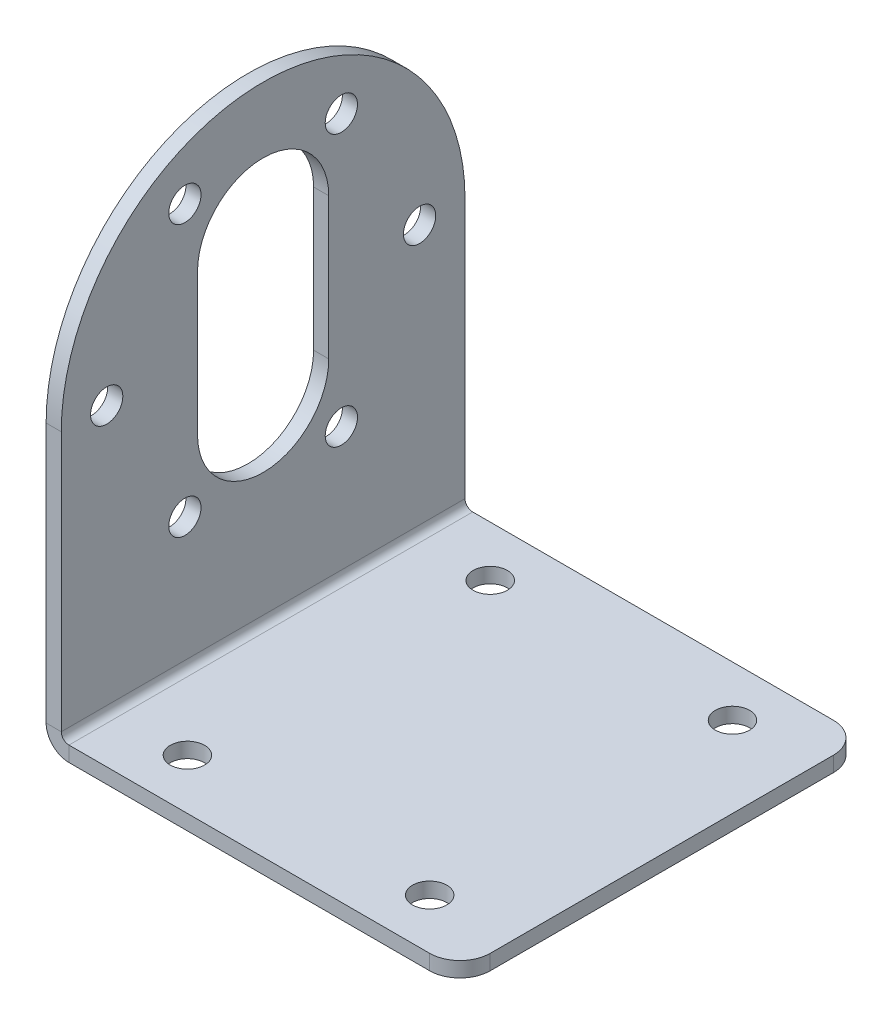
ISO-10303-21;
HEADER;
FILE_DESCRIPTION(('STEP AP214'),'2;1');
FILE_NAME('part.step','',(''),(''),'','','');
FILE_SCHEMA(('AUTOMOTIVE_DESIGN { 1 0 10303 214 1 1 1 1 }'));
ENDSEC;
DATA;
#1=APPLICATION_CONTEXT('core data for automotive mechanical design processes');
#2=APPLICATION_PROTOCOL_DEFINITION('international standard','automotive_design',2000,#1);
#3=PRODUCT_CONTEXT('',#1,'mechanical');
#4=PRODUCT('Part','Part','',(#3));
#5=PRODUCT_RELATED_PRODUCT_CATEGORY('part','',(#4));
#6=PRODUCT_DEFINITION_FORMATION('','',#4);
#7=PRODUCT_DEFINITION_CONTEXT('part definition',#1,'design');
#8=PRODUCT_DEFINITION('design','',#6,#7);
#9=PRODUCT_DEFINITION_SHAPE('','',#8);
#10=(LENGTH_UNIT() NAMED_UNIT(*) SI_UNIT(.MILLI.,.METRE.));
#11=(NAMED_UNIT(*) PLANE_ANGLE_UNIT() SI_UNIT($,.RADIAN.));
#12=(NAMED_UNIT(*) SI_UNIT($,.STERADIAN.) SOLID_ANGLE_UNIT());
#13=UNCERTAINTY_MEASURE_WITH_UNIT(LENGTH_MEASURE(1.E-05),#10,'distance_accuracy_value','');
#14=(GEOMETRIC_REPRESENTATION_CONTEXT(3) GLOBAL_UNCERTAINTY_ASSIGNED_CONTEXT((#13)) GLOBAL_UNIT_ASSIGNED_CONTEXT((#10,
#11,#12)) REPRESENTATION_CONTEXT('',''));
#15=CARTESIAN_POINT('',(0.,0.,0.));
#16=DIRECTION('',(0.,0.,1.));
#17=DIRECTION('',(1.,0.,0.));
#18=AXIS2_PLACEMENT_3D('',#15,#16,#17);
#19=CARTESIAN_POINT('',(0.,0.,0.));
#20=DIRECTION('',(1.,0.,0.));
#21=DIRECTION('',(0.,0.,-1.));
#22=AXIS2_PLACEMENT_3D('',#19,#20,#21);
#23=PLANE('',#22);
#24=DIRECTION('',(0.,-1.,0.));
#25=VECTOR('',#24,1.);
#26=CARTESIAN_POINT('',(0.,7.,-6.5));
#27=LINE('',#26,#25);
#28=CARTESIAN_POINT('',(0.,7.,-6.5));
#29=VERTEX_POINT('',#28);
#30=CARTESIAN_POINT('',(0.,-7.,-6.5));
#31=VERTEX_POINT('',#30);
#32=EDGE_CURVE('E160',#29,#31,#27,.T.);
#33=ORIENTED_EDGE('',*,*,#32,.F.);
#34=CARTESIAN_POINT('',(0.,7.,0.));
#35=DIRECTION('',(-1.,0.,0.));
#36=DIRECTION('',(0.,0.,1.));
#37=AXIS2_PLACEMENT_3D('',#34,#35,#36);
#38=CIRCLE('',#37,6.5);
#39=CARTESIAN_POINT('',(0.,7.,6.5));
#40=VERTEX_POINT('',#39);
#41=EDGE_CURVE('E165',#40,#29,#38,.T.);
#42=ORIENTED_EDGE('',*,*,#41,.F.);
#43=DIRECTION('',(0.,1.,0.));
#44=VECTOR('',#43,1.);
#45=CARTESIAN_POINT('',(0.,7.,6.5));
#46=LINE('',#45,#44);
#47=CARTESIAN_POINT('',(0.,-7.,6.5));
#48=VERTEX_POINT('',#47);
#49=EDGE_CURVE('E169',#48,#40,#46,.T.);
#50=ORIENTED_EDGE('',*,*,#49,.F.);
#51=CARTESIAN_POINT('',(0.,-7.,0.));
#52=DIRECTION('',(-1.,0.,0.));
#53=DIRECTION('',(0.,0.,1.));
#54=AXIS2_PLACEMENT_3D('',#51,#52,#53);
#55=CIRCLE('',#54,6.5);
#56=EDGE_CURVE('E149',#31,#48,#55,.T.);
#57=ORIENTED_EDGE('',*,*,#56,.F.);
#58=EDGE_LOOP('',(#33,#42,#50,#57));
#59=FACE_BOUND('',#58,.T.);
#60=CARTESIAN_POINT('',(0.,-13.4233937586589,7.74999999999988));
#61=DIRECTION('',(-1.,0.,0.));
#62=DIRECTION('',(0.,0.,1.));
#63=AXIS2_PLACEMENT_3D('',#60,#61,#62);
#64=CIRCLE('',#63,1.6);
#65=CARTESIAN_POINT('',(0.,-13.4233937586589,9.34999999999988));
#66=VERTEX_POINT('',#65);
#67=EDGE_CURVE('E184',#66,#66,#64,.T.);
#68=ORIENTED_EDGE('',*,*,#67,.F.);
#69=EDGE_LOOP('',(#68));
#70=FACE_BOUND('',#69,.T.);
#71=CARTESIAN_POINT('',(0.,13.4233937586588,7.75000000000006));
#72=DIRECTION('',(-1.,0.,0.));
#73=DIRECTION('',(0.,0.,1.));
#74=AXIS2_PLACEMENT_3D('',#71,#72,#73);
#75=CIRCLE('',#74,1.6);
#76=CARTESIAN_POINT('',(0.,13.4233937586588,9.35000000000006));
#77=VERTEX_POINT('',#76);
#78=EDGE_CURVE('E196',#77,#77,#75,.T.);
#79=ORIENTED_EDGE('',*,*,#78,.F.);
#80=EDGE_LOOP('',(#79));
#81=FACE_BOUND('',#80,.T.);
#82=CARTESIAN_POINT('',(0.,13.4233937586588,-7.74999999999997));
#83=DIRECTION('',(-1.,0.,0.));
#84=DIRECTION('',(0.,0.,1.));
#85=AXIS2_PLACEMENT_3D('',#82,#83,#84);
#86=CIRCLE('',#85,1.6);
#87=CARTESIAN_POINT('',(0.,13.4233937586588,-6.14999999999997));
#88=VERTEX_POINT('',#87);
#89=EDGE_CURVE('E202',#88,#88,#86,.T.);
#90=ORIENTED_EDGE('',*,*,#89,.F.);
#91=EDGE_LOOP('',(#90));
#92=FACE_BOUND('',#91,.T.);
#93=CARTESIAN_POINT('',(0.,0.,-15.5));
#94=DIRECTION('',(-1.,0.,0.));
#95=DIRECTION('',(0.,0.,1.));
#96=AXIS2_PLACEMENT_3D('',#93,#94,#95);
#97=CIRCLE('',#96,1.6);
#98=CARTESIAN_POINT('',(0.,0.,-13.9));
#99=VERTEX_POINT('',#98);
#100=EDGE_CURVE('E206',#99,#99,#97,.T.);
#101=ORIENTED_EDGE('',*,*,#100,.F.);
#102=EDGE_LOOP('',(#101));
#103=FACE_BOUND('',#102,.T.);
#104=DIRECTION('',(0.,1.,0.));
#105=VECTOR('',#104,1.);
#106=CARTESIAN_POINT('',(0.,0.,-20.));
#107=LINE('',#106,#105);
#108=CARTESIAN_POINT('',(0.,-25.738,-20.));
#109=VERTEX_POINT('',#108);
#110=CARTESIAN_POINT('',(0.,0.,-20.));
#111=VERTEX_POINT('',#110);
#112=EDGE_CURVE('E227',#109,#111,#107,.T.);
#113=ORIENTED_EDGE('',*,*,#112,.F.);
#114=DIRECTION('',(0.,0.,-1.));
#115=VECTOR('',#114,1.);
#116=CARTESIAN_POINT('',(0.,-25.738,0.));
#117=LINE('',#116,#115);
#118=CARTESIAN_POINT('',(0.,-25.738,20.));
#119=VERTEX_POINT('',#118);
#120=EDGE_CURVE('E233',#109,#119,#117,.F.);
#121=ORIENTED_EDGE('',*,*,#120,.T.);
#122=DIRECTION('',(0.,-1.,0.));
#123=VECTOR('',#122,1.);
#124=CARTESIAN_POINT('',(0.,0.,20.));
#125=LINE('',#124,#123);
#126=CARTESIAN_POINT('',(0.,0.,20.));
#127=VERTEX_POINT('',#126);
#128=EDGE_CURVE('E221',#127,#119,#125,.T.);
#129=ORIENTED_EDGE('',*,*,#128,.F.);
#130=CARTESIAN_POINT('',(0.,0.,0.));
#131=DIRECTION('',(1.,0.,0.));
#132=DIRECTION('',(0.,0.,-1.));
#133=AXIS2_PLACEMENT_3D('',#130,#131,#132);
#134=CIRCLE('',#133,20.);
#135=EDGE_CURVE('E224',#111,#127,#134,.T.);
#136=ORIENTED_EDGE('',*,*,#135,.F.);
#137=EDGE_LOOP('',(#113,#121,#129,#136));
#138=FACE_BOUND('',#137,.T.);
#139=CARTESIAN_POINT('',(0.,0.,15.5));
#140=DIRECTION('',(-1.,0.,0.));
#141=DIRECTION('',(0.,0.,1.));
#142=AXIS2_PLACEMENT_3D('',#139,#140,#141);
#143=CIRCLE('',#142,1.6);
#144=CARTESIAN_POINT('',(0.,0.,17.1));
#145=VERTEX_POINT('',#144);
#146=EDGE_CURVE('E190',#145,#145,#143,.T.);
#147=ORIENTED_EDGE('',*,*,#146,.F.);
#148=EDGE_LOOP('',(#147));
#149=FACE_BOUND('',#148,.T.);
#150=CARTESIAN_POINT('',(0.,-13.4233937586587,-7.75000000000016));
#151=DIRECTION('',(-1.,0.,0.));
#152=DIRECTION('',(0.,0.,1.));
#153=AXIS2_PLACEMENT_3D('',#150,#151,#152);
#154=CIRCLE('',#153,1.6);
#155=CARTESIAN_POINT('',(0.,-13.4233937586587,-6.15000000000016));
#156=VERTEX_POINT('',#155);
#157=EDGE_CURVE('E176',#156,#156,#154,.T.);
#158=ORIENTED_EDGE('',*,*,#157,.F.);
#159=EDGE_LOOP('',(#158));
#160=FACE_BOUND('',#159,.T.);
#161=ADVANCED_FACE('F43',(#59,#70,#81,#92,#103,#138,#149,#160),#23,.F.);
#162=CARTESIAN_POINT('',(1.5,-28.,-20.));
#163=DIRECTION('',(0.,0.,-1.));
#164=DIRECTION('',(-1.,0.,0.));
#165=AXIS2_PLACEMENT_3D('',#162,#163,#164);
#166=PLANE('',#165);
#167=DIRECTION('',(1.,0.,0.));
#168=VECTOR('',#167,1.);
#169=CARTESIAN_POINT('',(1.5,-26.5,-20.));
#170=LINE('',#169,#168);
#171=CARTESIAN_POINT('',(38.,-26.5,-20.));
#172=VERTEX_POINT('',#171);
#173=CARTESIAN_POINT('',(2.262,-26.5,-20.));
#174=VERTEX_POINT('',#173);
#175=EDGE_CURVE('E261',#172,#174,#170,.F.);
#176=ORIENTED_EDGE('',*,*,#175,.F.);
#177=DIRECTION('',(0.,1.,0.));
#178=VECTOR('',#177,1.);
#179=CARTESIAN_POINT('',(38.,-28.,-20.));
#180=LINE('',#179,#178);
#181=CARTESIAN_POINT('',(38.,-28.,-20.));
#182=VERTEX_POINT('',#181);
#183=EDGE_CURVE('E290',#172,#182,#180,.F.);
#184=ORIENTED_EDGE('',*,*,#183,.T.);
#185=DIRECTION('',(-1.,0.,0.));
#186=VECTOR('',#185,1.);
#187=CARTESIAN_POINT('',(1.5,-28.,-20.));
#188=LINE('',#187,#186);
#189=CARTESIAN_POINT('',(2.262,-28.,-20.));
#190=VERTEX_POINT('',#189);
#191=EDGE_CURVE('E213',#182,#190,#188,.T.);
#192=ORIENTED_EDGE('',*,*,#191,.T.);
#193=DIRECTION('',(0.,-1.,0.));
#194=VECTOR('',#193,1.);
#195=CARTESIAN_POINT('',(2.262,-28.,-20.));
#196=LINE('',#195,#194);
#197=EDGE_CURVE('E277',#174,#190,#196,.T.);
#198=ORIENTED_EDGE('',*,*,#197,.F.);
#199=EDGE_LOOP('',(#176,#184,#192,#198));
#200=FACE_BOUND('',#199,.T.);
#201=ADVANCED_FACE('F311',(#200),#166,.T.);
#202=CARTESIAN_POINT('',(41.,-28.,20.));
#203=DIRECTION('',(-1.,0.,0.));
#204=DIRECTION('',(0.,0.,1.));
#205=AXIS2_PLACEMENT_3D('',#202,#203,#204);
#206=PLANE('',#205);
#207=DIRECTION('',(0.,0.,1.));
#208=VECTOR('',#207,1.);
#209=CARTESIAN_POINT('',(41.,-28.,20.));
#210=LINE('',#209,#208);
#211=CARTESIAN_POINT('',(41.,-28.,-17.));
#212=VERTEX_POINT('',#211);
#213=CARTESIAN_POINT('',(41.,-28.,17.));
#214=VERTEX_POINT('',#213);
#215=EDGE_CURVE('E215',#212,#214,#210,.T.);
#216=ORIENTED_EDGE('',*,*,#215,.F.);
#217=DIRECTION('',(0.,-1.,0.));
#218=VECTOR('',#217,1.);
#219=CARTESIAN_POINT('',(41.,-28.,-17.));
#220=LINE('',#219,#218);
#221=CARTESIAN_POINT('',(41.,-26.5,-17.));
#222=VERTEX_POINT('',#221);
#223=EDGE_CURVE('E300',#212,#222,#220,.F.);
#224=ORIENTED_EDGE('',*,*,#223,.T.);
#225=DIRECTION('',(0.,0.,1.));
#226=VECTOR('',#225,1.);
#227=CARTESIAN_POINT('',(41.,-26.5,20.));
#228=LINE('',#227,#226);
#229=CARTESIAN_POINT('',(41.,-26.5,17.));
#230=VERTEX_POINT('',#229);
#231=EDGE_CURVE('E263',#222,#230,#228,.T.);
#232=ORIENTED_EDGE('',*,*,#231,.T.);
#233=DIRECTION('',(0.,1.,0.));
#234=VECTOR('',#233,1.);
#235=CARTESIAN_POINT('',(41.,-28.,17.));
#236=LINE('',#235,#234);
#237=EDGE_CURVE('E297',#230,#214,#236,.F.);
#238=ORIENTED_EDGE('',*,*,#237,.T.);
#239=EDGE_LOOP('',(#216,#224,#232,#238));
#240=FACE_BOUND('',#239,.T.);
#241=ADVANCED_FACE('F318',(#240),#206,.F.);
#242=CARTESIAN_POINT('',(1.5,-28.,20.));
#243=DIRECTION('',(0.,0.,-1.));
#244=DIRECTION('',(-1.,0.,0.));
#245=AXIS2_PLACEMENT_3D('',#242,#243,#244);
#246=PLANE('',#245);
#247=DIRECTION('',(-1.,0.,0.));
#248=VECTOR('',#247,1.);
#249=CARTESIAN_POINT('',(1.5,-28.,20.));
#250=LINE('',#249,#248);
#251=CARTESIAN_POINT('',(38.,-28.,20.));
#252=VERTEX_POINT('',#251);
#253=CARTESIAN_POINT('',(2.262,-28.,20.));
#254=VERTEX_POINT('',#253);
#255=EDGE_CURVE('E219',#252,#254,#250,.T.);
#256=ORIENTED_EDGE('',*,*,#255,.F.);
#257=DIRECTION('',(0.,1.,0.));
#258=VECTOR('',#257,1.);
#259=CARTESIAN_POINT('',(38.,-28.,20.));
#260=LINE('',#259,#258);
#261=CARTESIAN_POINT('',(38.,-26.5,20.));
#262=VERTEX_POINT('',#261);
#263=EDGE_CURVE('E11',#252,#262,#260,.T.);
#264=ORIENTED_EDGE('',*,*,#263,.T.);
#265=DIRECTION('',(1.,0.,0.));
#266=VECTOR('',#265,1.);
#267=CARTESIAN_POINT('',(1.5,-26.5,20.));
#268=LINE('',#267,#266);
#269=CARTESIAN_POINT('',(2.262,-26.5,20.));
#270=VERTEX_POINT('',#269);
#271=EDGE_CURVE('E257',#262,#270,#268,.F.);
#272=ORIENTED_EDGE('',*,*,#271,.T.);
#273=DIRECTION('',(0.,-1.,0.));
#274=VECTOR('',#273,1.);
#275=CARTESIAN_POINT('',(2.262,-28.,20.));
#276=LINE('',#275,#274);
#277=EDGE_CURVE('E274',#270,#254,#276,.T.);
#278=ORIENTED_EDGE('',*,*,#277,.T.);
#279=EDGE_LOOP('',(#256,#264,#272,#278));
#280=FACE_BOUND('',#279,.T.);
#281=ADVANCED_FACE('F321',(#280),#246,.F.);
#282=CARTESIAN_POINT('',(2.262,-25.738,20.));
#283=DIRECTION('',(0.,0.,1.));
#284=DIRECTION('',(0.,-1.,0.));
#285=AXIS2_PLACEMENT_3D('',#282,#283,#284);
#286=PLANE('',#285);
#287=ORIENTED_EDGE('',*,*,#277,.F.);
#288=CARTESIAN_POINT('',(2.262,-25.738,20.));
#289=DIRECTION('',(0.,0.,-1.));
#290=DIRECTION('',(-1.,0.,0.));
#291=AXIS2_PLACEMENT_3D('',#288,#289,#290);
#292=CIRCLE('',#291,0.762);
#293=CARTESIAN_POINT('',(1.5,-25.738,20.));
#294=VERTEX_POINT('',#293);
#295=EDGE_CURVE('E258',#270,#294,#292,.T.);
#296=ORIENTED_EDGE('',*,*,#295,.T.);
#297=DIRECTION('',(-1.,0.,0.));
#298=VECTOR('',#297,1.);
#299=CARTESIAN_POINT('',(0.,-25.738,20.));
#300=LINE('',#299,#298);
#301=EDGE_CURVE('E272',#294,#119,#300,.T.);
#302=ORIENTED_EDGE('',*,*,#301,.T.);
#303=CARTESIAN_POINT('',(2.262,-25.738,20.));
#304=DIRECTION('',(0.,0.,-1.));
#305=DIRECTION('',(0.,1.,0.));
#306=AXIS2_PLACEMENT_3D('',#303,#304,#305);
#307=CIRCLE('',#306,2.262);
#308=EDGE_CURVE('E216',#254,#119,#307,.T.);
#309=ORIENTED_EDGE('',*,*,#308,.F.);
#310=EDGE_LOOP('',(#287,#296,#302,#309));
#311=FACE_BOUND('',#310,.T.);
#312=ADVANCED_FACE('F326',(#311),#286,.T.);
#313=CARTESIAN_POINT('',(0.,0.,20.));
#314=DIRECTION('',(0.,0.,1.));
#315=DIRECTION('',(0.,-1.,0.));
#316=AXIS2_PLACEMENT_3D('',#313,#314,#315);
#317=PLANE('',#316);
#318=ORIENTED_EDGE('',*,*,#301,.F.);
#319=DIRECTION('',(0.,1.,0.));
#320=VECTOR('',#319,1.);
#321=CARTESIAN_POINT('',(1.5,0.,20.));
#322=LINE('',#321,#320);
#323=CARTESIAN_POINT('',(1.5,0.,20.));
#324=VERTEX_POINT('',#323);
#325=EDGE_CURVE('E254',#324,#294,#322,.F.);
#326=ORIENTED_EDGE('',*,*,#325,.F.);
#327=DIRECTION('',(-1.,0.,0.));
#328=VECTOR('',#327,1.);
#329=CARTESIAN_POINT('',(0.,0.,20.));
#330=LINE('',#329,#328);
#331=EDGE_CURVE('E270',#324,#127,#330,.T.);
#332=ORIENTED_EDGE('',*,*,#331,.T.);
#333=ORIENTED_EDGE('',*,*,#128,.T.);
#334=EDGE_LOOP('',(#318,#326,#332,#333));
#335=FACE_BOUND('',#334,.T.);
#336=ADVANCED_FACE('F509',(#335),#317,.T.);
#337=CARTESIAN_POINT('',(0.,0.,0.));
#338=DIRECTION('',(1.,0.,0.));
#339=DIRECTION('',(0.,0.,-1.));
#340=AXIS2_PLACEMENT_3D('',#337,#338,#339);
#341=CYLINDRICAL_SURFACE('',#340,20.);
#342=ORIENTED_EDGE('',*,*,#331,.F.);
#343=CARTESIAN_POINT('',(1.5,0.,0.));
#344=DIRECTION('',(1.,0.,0.));
#345=DIRECTION('',(0.,0.,-1.));
#346=AXIS2_PLACEMENT_3D('',#343,#344,#345);
#347=CIRCLE('',#346,20.);
#348=CARTESIAN_POINT('',(1.5,0.,-20.));
#349=VERTEX_POINT('',#348);
#350=EDGE_CURVE('E251',#349,#324,#347,.T.);
#351=ORIENTED_EDGE('',*,*,#350,.F.);
#352=DIRECTION('',(-1.,0.,0.));
#353=VECTOR('',#352,1.);
#354=CARTESIAN_POINT('',(0.,0.,-20.));
#355=LINE('',#354,#353);
#356=EDGE_CURVE('E268',#349,#111,#355,.T.);
#357=ORIENTED_EDGE('',*,*,#356,.T.);
#358=ORIENTED_EDGE('',*,*,#135,.T.);
#359=EDGE_LOOP('',(#342,#351,#357,#358));
#360=FACE_BOUND('',#359,.T.);
#361=ADVANCED_FACE('F501',(#360),#341,.T.);
#362=CARTESIAN_POINT('',(0.,0.,-20.));
#363=DIRECTION('',(0.,0.,-1.));
#364=DIRECTION('',(0.,1.,0.));
#365=AXIS2_PLACEMENT_3D('',#362,#363,#364);
#366=PLANE('',#365);
#367=ORIENTED_EDGE('',*,*,#356,.F.);
#368=DIRECTION('',(0.,1.,0.));
#369=VECTOR('',#368,1.);
#370=CARTESIAN_POINT('',(1.5,0.,-20.));
#371=LINE('',#370,#369);
#372=CARTESIAN_POINT('',(1.5,-25.738,-20.));
#373=VERTEX_POINT('',#372);
#374=EDGE_CURVE('E248',#373,#349,#371,.T.);
#375=ORIENTED_EDGE('',*,*,#374,.F.);
#376=DIRECTION('',(-1.,0.,0.));
#377=VECTOR('',#376,1.);
#378=CARTESIAN_POINT('',(0.,-25.738,-20.));
#379=LINE('',#378,#377);
#380=EDGE_CURVE('E236',#373,#109,#379,.T.);
#381=ORIENTED_EDGE('',*,*,#380,.T.);
#382=ORIENTED_EDGE('',*,*,#112,.T.);
#383=EDGE_LOOP('',(#367,#375,#381,#382));
#384=FACE_BOUND('',#383,.T.);
#385=ADVANCED_FACE('F340',(#384),#366,.T.);
#386=CARTESIAN_POINT('',(2.262,-25.738,-20.));
#387=DIRECTION('',(0.,0.,1.));
#388=DIRECTION('',(0.,-1.,0.));
#389=AXIS2_PLACEMENT_3D('',#386,#387,#388);
#390=PLANE('',#389);
#391=CARTESIAN_POINT('',(2.262,-25.738,-20.));
#392=DIRECTION('',(0.,0.,-1.));
#393=DIRECTION('',(-1.,0.,0.));
#394=AXIS2_PLACEMENT_3D('',#391,#392,#393);
#395=CIRCLE('',#394,0.762);
#396=EDGE_CURVE('E212',#373,#174,#395,.F.);
#397=ORIENTED_EDGE('',*,*,#396,.T.);
#398=ORIENTED_EDGE('',*,*,#197,.T.);
#399=CARTESIAN_POINT('',(2.262,-25.738,-20.));
#400=DIRECTION('',(0.,0.,-1.));
#401=DIRECTION('',(0.,1.,0.));
#402=AXIS2_PLACEMENT_3D('',#399,#400,#401);
#403=CIRCLE('',#402,2.262);
#404=EDGE_CURVE('E237',#109,#190,#403,.F.);
#405=ORIENTED_EDGE('',*,*,#404,.F.);
#406=ORIENTED_EDGE('',*,*,#380,.F.);
#407=EDGE_LOOP('',(#397,#398,#405,#406));
#408=FACE_BOUND('',#407,.T.);
#409=ADVANCED_FACE('F333',(#408),#390,.F.);
#410=CARTESIAN_POINT('',(1.5,-28.,20.));
#411=DIRECTION('',(0.,1.,0.));
#412=DIRECTION('',(0.,0.,1.));
#413=AXIS2_PLACEMENT_3D('',#410,#411,#412);
#414=PLANE('',#413);
#415=CARTESIAN_POINT('',(9.00000000000001,-28.,-15.));
#416=DIRECTION('',(0.,1.,0.));
#417=DIRECTION('',(0.,0.,1.));
#418=AXIS2_PLACEMENT_3D('',#415,#416,#417);
#419=CIRCLE('',#418,1.7);
#420=CARTESIAN_POINT('',(9.00000000000001,-28.,-13.3));
#421=VERTEX_POINT('',#420);
#422=EDGE_CURVE('E452',#421,#421,#419,.T.);
#423=ORIENTED_EDGE('',*,*,#422,.T.);
#424=EDGE_LOOP('',(#423));
#425=FACE_BOUND('',#424,.T.);
#426=CARTESIAN_POINT('',(9.00000000000001,-28.,15.));
#427=DIRECTION('',(0.,1.,0.));
#428=DIRECTION('',(0.,0.,1.));
#429=AXIS2_PLACEMENT_3D('',#426,#427,#428);
#430=CIRCLE('',#429,1.7);
#431=CARTESIAN_POINT('',(9.00000000000001,-28.,16.7));
#432=VERTEX_POINT('',#431);
#433=EDGE_CURVE('E456',#432,#432,#430,.T.);
#434=ORIENTED_EDGE('',*,*,#433,.T.);
#435=EDGE_LOOP('',(#434));
#436=FACE_BOUND('',#435,.T.);
#437=CARTESIAN_POINT('',(33.,-28.,15.));
#438=DIRECTION('',(0.,1.,0.));
#439=DIRECTION('',(0.,0.,1.));
#440=AXIS2_PLACEMENT_3D('',#437,#438,#439);
#441=CIRCLE('',#440,1.7);
#442=CARTESIAN_POINT('',(33.,-28.,16.7));
#443=VERTEX_POINT('',#442);
#444=EDGE_CURVE('E468',#443,#443,#441,.T.);
#445=ORIENTED_EDGE('',*,*,#444,.T.);
#446=EDGE_LOOP('',(#445));
#447=FACE_BOUND('',#446,.T.);
#448=CARTESIAN_POINT('',(33.,-28.,-15.));
#449=DIRECTION('',(0.,1.,0.));
#450=DIRECTION('',(0.,0.,1.));
#451=AXIS2_PLACEMENT_3D('',#448,#449,#450);
#452=CIRCLE('',#451,1.7);
#453=CARTESIAN_POINT('',(33.,-28.,-13.3));
#454=VERTEX_POINT('',#453);
#455=EDGE_CURVE('E474',#454,#454,#452,.T.);
#456=ORIENTED_EDGE('',*,*,#455,.T.);
#457=EDGE_LOOP('',(#456));
#458=FACE_BOUND('',#457,.T.);
#459=ORIENTED_EDGE('',*,*,#191,.F.);
#460=CARTESIAN_POINT('',(38.,-28.,-17.));
#461=DIRECTION('',(0.,1.,0.));
#462=DIRECTION('',(0.,0.,1.));
#463=AXIS2_PLACEMENT_3D('',#460,#461,#462);
#464=CIRCLE('',#463,3.);
#465=EDGE_CURVE('E295',#182,#212,#464,.F.);
#466=ORIENTED_EDGE('',*,*,#465,.T.);
#467=ORIENTED_EDGE('',*,*,#215,.T.);
#468=CARTESIAN_POINT('',(38.,-28.,17.));
#469=DIRECTION('',(0.,1.,0.));
#470=DIRECTION('',(0.,0.,1.));
#471=AXIS2_PLACEMENT_3D('',#468,#469,#470);
#472=CIRCLE('',#471,3.);
#473=EDGE_CURVE('E293',#214,#252,#472,.F.);
#474=ORIENTED_EDGE('',*,*,#473,.T.);
#475=ORIENTED_EDGE('',*,*,#255,.T.);
#476=DIRECTION('',(0.,0.,-1.));
#477=VECTOR('',#476,1.);
#478=CARTESIAN_POINT('',(2.262,-28.,20.));
#479=LINE('',#478,#477);
#480=EDGE_CURVE('E230',#254,#190,#479,.T.);
#481=ORIENTED_EDGE('',*,*,#480,.T.);
#482=EDGE_LOOP('',(#459,#466,#467,#474,#475,#481));
#483=FACE_BOUND('',#482,.T.);
#484=ADVANCED_FACE('F316',(#425,#436,#447,#458,#483),#414,.F.);
#485=CARTESIAN_POINT('',(2.262,-25.738,20.));
#486=DIRECTION('',(0.,0.,-1.));
#487=DIRECTION('',(-1.,0.,0.));
#488=AXIS2_PLACEMENT_3D('',#485,#486,#487);
#489=CYLINDRICAL_SURFACE('',#488,2.262);
#490=ORIENTED_EDGE('',*,*,#308,.T.);
#491=ORIENTED_EDGE('',*,*,#120,.F.);
#492=ORIENTED_EDGE('',*,*,#404,.T.);
#493=ORIENTED_EDGE('',*,*,#480,.F.);
#494=EDGE_LOOP('',(#490,#491,#492,#493));
#495=FACE_BOUND('',#494,.T.);
#496=ADVANCED_FACE('F329',(#495),#489,.T.);
#497=CARTESIAN_POINT('',(1.5,0.,0.));
#498=DIRECTION('',(1.,0.,0.));
#499=DIRECTION('',(0.,0.,-1.));
#500=AXIS2_PLACEMENT_3D('',#497,#498,#499);
#501=PLANE('',#500);
#502=CARTESIAN_POINT('',(1.5,7.,0.));
#503=DIRECTION('',(1.,0.,0.));
#504=DIRECTION('',(0.,0.,-1.));
#505=AXIS2_PLACEMENT_3D('',#502,#503,#504);
#506=CIRCLE('',#505,6.5);
#507=CARTESIAN_POINT('',(1.50000000000002,7.,-6.5));
#508=VERTEX_POINT('',#507);
#509=CARTESIAN_POINT('',(1.50000000000002,7.,6.5));
#510=VERTEX_POINT('',#509);
#511=EDGE_CURVE('E288',#508,#510,#506,.T.);
#512=ORIENTED_EDGE('',*,*,#511,.F.);
#513=DIRECTION('',(0.,1.,0.));
#514=VECTOR('',#513,1.);
#515=CARTESIAN_POINT('',(1.5,0.,-6.5));
#516=LINE('',#515,#514);
#517=CARTESIAN_POINT('',(1.5,-7.,-6.5));
#518=VERTEX_POINT('',#517);
#519=EDGE_CURVE('E280',#518,#508,#516,.T.);
#520=ORIENTED_EDGE('',*,*,#519,.F.);
#521=CARTESIAN_POINT('',(1.5,-7.,0.));
#522=DIRECTION('',(1.,0.,0.));
#523=DIRECTION('',(0.,0.,-1.));
#524=AXIS2_PLACEMENT_3D('',#521,#522,#523);
#525=CIRCLE('',#524,6.5);
#526=CARTESIAN_POINT('',(1.50000000000002,-7.,6.5));
#527=VERTEX_POINT('',#526);
#528=EDGE_CURVE('E152',#527,#518,#525,.T.);
#529=ORIENTED_EDGE('',*,*,#528,.F.);
#530=DIRECTION('',(0.,-1.,0.));
#531=VECTOR('',#530,1.);
#532=CARTESIAN_POINT('',(1.5,0.,6.5));
#533=LINE('',#532,#531);
#534=EDGE_CURVE('E286',#510,#527,#533,.T.);
#535=ORIENTED_EDGE('',*,*,#534,.F.);
#536=EDGE_LOOP('',(#512,#520,#529,#535));
#537=FACE_BOUND('',#536,.T.);
#538=CARTESIAN_POINT('',(1.5,-13.4233937586587,-7.75000000000016));
#539=DIRECTION('',(1.,0.,0.));
#540=DIRECTION('',(0.,0.,-1.));
#541=AXIS2_PLACEMENT_3D('',#538,#539,#540);
#542=CIRCLE('',#541,1.59999999999999);
#543=CARTESIAN_POINT('',(1.5,-13.4233937586587,-9.35000000000015));
#544=VERTEX_POINT('',#543);
#545=EDGE_CURVE('E181',#544,#544,#542,.T.);
#546=ORIENTED_EDGE('',*,*,#545,.F.);
#547=EDGE_LOOP('',(#546));
#548=FACE_BOUND('',#547,.T.);
#549=CARTESIAN_POINT('',(1.5,-13.4233937586589,7.74999999999988));
#550=DIRECTION('',(1.,0.,0.));
#551=DIRECTION('',(0.,0.,-1.));
#552=AXIS2_PLACEMENT_3D('',#549,#550,#551);
#553=CIRCLE('',#552,1.59999999999999);
#554=CARTESIAN_POINT('',(1.5,-13.4233937586589,6.14999999999988));
#555=VERTEX_POINT('',#554);
#556=EDGE_CURVE('E187',#555,#555,#553,.T.);
#557=ORIENTED_EDGE('',*,*,#556,.F.);
#558=EDGE_LOOP('',(#557));
#559=FACE_BOUND('',#558,.T.);
#560=CARTESIAN_POINT('',(1.5,0.,15.5));
#561=DIRECTION('',(1.,0.,0.));
#562=DIRECTION('',(0.,0.,-1.));
#563=AXIS2_PLACEMENT_3D('',#560,#561,#562);
#564=CIRCLE('',#563,1.59999999999999);
#565=CARTESIAN_POINT('',(1.5,0.,13.9));
#566=VERTEX_POINT('',#565);
#567=EDGE_CURVE('E193',#566,#566,#564,.T.);
#568=ORIENTED_EDGE('',*,*,#567,.F.);
#569=EDGE_LOOP('',(#568));
#570=FACE_BOUND('',#569,.T.);
#571=CARTESIAN_POINT('',(1.5,13.4233937586588,7.75000000000006));
#572=DIRECTION('',(1.,0.,0.));
#573=DIRECTION('',(0.,0.,-1.));
#574=AXIS2_PLACEMENT_3D('',#571,#572,#573);
#575=CIRCLE('',#574,1.59999999999999);
#576=CARTESIAN_POINT('',(1.5,13.4233937586588,6.15000000000007));
#577=VERTEX_POINT('',#576);
#578=EDGE_CURVE('E199',#577,#577,#575,.T.);
#579=ORIENTED_EDGE('',*,*,#578,.F.);
#580=EDGE_LOOP('',(#579));
#581=FACE_BOUND('',#580,.T.);
#582=CARTESIAN_POINT('',(1.5,13.4233937586588,-7.74999999999997));
#583=DIRECTION('',(1.,0.,0.));
#584=DIRECTION('',(0.,0.,-1.));
#585=AXIS2_PLACEMENT_3D('',#582,#583,#584);
#586=CIRCLE('',#585,1.59999999999999);
#587=CARTESIAN_POINT('',(1.5,13.4233937586588,-9.34999999999996));
#588=VERTEX_POINT('',#587);
#589=EDGE_CURVE('E205',#588,#588,#586,.T.);
#590=ORIENTED_EDGE('',*,*,#589,.F.);
#591=EDGE_LOOP('',(#590));
#592=FACE_BOUND('',#591,.T.);
#593=CARTESIAN_POINT('',(1.5,0.,-15.5));
#594=DIRECTION('',(1.,0.,0.));
#595=DIRECTION('',(0.,0.,-1.));
#596=AXIS2_PLACEMENT_3D('',#593,#594,#595);
#597=CIRCLE('',#596,1.59999999999999);
#598=CARTESIAN_POINT('',(1.5,0.,-17.1));
#599=VERTEX_POINT('',#598);
#600=EDGE_CURVE('E209',#599,#599,#597,.T.);
#601=ORIENTED_EDGE('',*,*,#600,.F.);
#602=EDGE_LOOP('',(#601));
#603=FACE_BOUND('',#602,.T.);
#604=ORIENTED_EDGE('',*,*,#374,.T.);
#605=ORIENTED_EDGE('',*,*,#350,.T.);
#606=ORIENTED_EDGE('',*,*,#325,.T.);
#607=DIRECTION('',(0.,0.,-1.));
#608=VECTOR('',#607,1.);
#609=CARTESIAN_POINT('',(1.5,-25.738,0.));
#610=LINE('',#609,#608);
#611=EDGE_CURVE('E240',#373,#294,#610,.F.);
#612=ORIENTED_EDGE('',*,*,#611,.F.);
#613=EDGE_LOOP('',(#604,#605,#606,#612));
#614=FACE_BOUND('',#613,.T.);
#615=ADVANCED_FACE('F344',(#537,#548,#559,#570,#581,#592,#603,#614),#501,.T.);
#616=CARTESIAN_POINT('',(1.5,-26.5,20.));
#617=DIRECTION('',(0.,1.,0.));
#618=DIRECTION('',(0.,0.,1.));
#619=AXIS2_PLACEMENT_3D('',#616,#617,#618);
#620=PLANE('',#619);
#621=CARTESIAN_POINT('',(9.00000000000001,-26.5,-15.));
#622=DIRECTION('',(0.,1.,0.));
#623=DIRECTION('',(0.,0.,1.));
#624=AXIS2_PLACEMENT_3D('',#621,#622,#623);
#625=CIRCLE('',#624,1.7);
#626=CARTESIAN_POINT('',(9.00000000000001,-26.5,-13.3));
#627=VERTEX_POINT('',#626);
#628=EDGE_CURVE('E455',#627,#627,#625,.T.);
#629=ORIENTED_EDGE('',*,*,#628,.F.);
#630=EDGE_LOOP('',(#629));
#631=FACE_BOUND('',#630,.T.);
#632=CARTESIAN_POINT('',(9.00000000000001,-26.5,15.));
#633=DIRECTION('',(0.,1.,0.));
#634=DIRECTION('',(0.,0.,1.));
#635=AXIS2_PLACEMENT_3D('',#632,#633,#634);
#636=CIRCLE('',#635,1.7);
#637=CARTESIAN_POINT('',(9.00000000000001,-26.5,16.7));
#638=VERTEX_POINT('',#637);
#639=EDGE_CURVE('E459',#638,#638,#636,.T.);
#640=ORIENTED_EDGE('',*,*,#639,.F.);
#641=EDGE_LOOP('',(#640));
#642=FACE_BOUND('',#641,.T.);
#643=CARTESIAN_POINT('',(33.,-26.5,15.));
#644=DIRECTION('',(0.,1.,0.));
#645=DIRECTION('',(0.,0.,1.));
#646=AXIS2_PLACEMENT_3D('',#643,#644,#645);
#647=CIRCLE('',#646,1.7);
#648=CARTESIAN_POINT('',(33.,-26.5,16.7));
#649=VERTEX_POINT('',#648);
#650=EDGE_CURVE('E465',#649,#649,#647,.T.);
#651=ORIENTED_EDGE('',*,*,#650,.F.);
#652=EDGE_LOOP('',(#651));
#653=FACE_BOUND('',#652,.T.);
#654=CARTESIAN_POINT('',(33.,-26.5,-15.));
#655=DIRECTION('',(0.,1.,0.));
#656=DIRECTION('',(0.,0.,1.));
#657=AXIS2_PLACEMENT_3D('',#654,#655,#656);
#658=CIRCLE('',#657,1.7);
#659=CARTESIAN_POINT('',(33.,-26.5,-13.3));
#660=VERTEX_POINT('',#659);
#661=EDGE_CURVE('E471',#660,#660,#658,.T.);
#662=ORIENTED_EDGE('',*,*,#661,.F.);
#663=EDGE_LOOP('',(#662));
#664=FACE_BOUND('',#663,.T.);
#665=ORIENTED_EDGE('',*,*,#231,.F.);
#666=CARTESIAN_POINT('',(38.,-26.5,-17.));
#667=DIRECTION('',(0.,1.,0.));
#668=DIRECTION('',(0.,0.,1.));
#669=AXIS2_PLACEMENT_3D('',#666,#667,#668);
#670=CIRCLE('',#669,3.);
#671=EDGE_CURVE('E51',#222,#172,#670,.T.);
#672=ORIENTED_EDGE('',*,*,#671,.T.);
#673=ORIENTED_EDGE('',*,*,#175,.T.);
#674=DIRECTION('',(0.,0.,1.));
#675=VECTOR('',#674,1.);
#676=CARTESIAN_POINT('',(2.262,-26.5,20.));
#677=LINE('',#676,#675);
#678=EDGE_CURVE('E245',#270,#174,#677,.F.);
#679=ORIENTED_EDGE('',*,*,#678,.F.);
#680=ORIENTED_EDGE('',*,*,#271,.F.);
#681=CARTESIAN_POINT('',(38.,-26.5,17.));
#682=DIRECTION('',(0.,1.,0.));
#683=DIRECTION('',(0.,0.,1.));
#684=AXIS2_PLACEMENT_3D('',#681,#682,#683);
#685=CIRCLE('',#684,3.);
#686=EDGE_CURVE('E63',#262,#230,#685,.T.);
#687=ORIENTED_EDGE('',*,*,#686,.T.);
#688=EDGE_LOOP('',(#665,#672,#673,#679,#680,#687));
#689=FACE_BOUND('',#688,.T.);
#690=ADVANCED_FACE('F304',(#631,#642,#653,#664,#689),#620,.T.);
#691=CARTESIAN_POINT('',(2.262,-25.738,20.));
#692=DIRECTION('',(0.,0.,-1.));
#693=DIRECTION('',(-1.,0.,0.));
#694=AXIS2_PLACEMENT_3D('',#691,#692,#693);
#695=CYLINDRICAL_SURFACE('',#694,0.762);
#696=ORIENTED_EDGE('',*,*,#295,.F.);
#697=ORIENTED_EDGE('',*,*,#678,.T.);
#698=ORIENTED_EDGE('',*,*,#396,.F.);
#699=ORIENTED_EDGE('',*,*,#611,.T.);
#700=EDGE_LOOP('',(#696,#697,#698,#699));
#701=FACE_BOUND('',#700,.T.);
#702=ADVANCED_FACE('F349',(#701),#695,.F.);
#703=CARTESIAN_POINT('',(0.,0.,-15.5));
#704=DIRECTION('',(-1.,0.,0.));
#705=DIRECTION('',(0.,0.,1.));
#706=AXIS2_PLACEMENT_3D('',#703,#704,#705);
#707=CYLINDRICAL_SURFACE('',#706,1.59999999999999);
#708=ORIENTED_EDGE('',*,*,#600,.T.);
#709=EDGE_LOOP('',(#708));
#710=FACE_BOUND('',#709,.T.);
#711=ORIENTED_EDGE('',*,*,#100,.T.);
#712=EDGE_LOOP('',(#711));
#713=FACE_BOUND('',#712,.T.);
#714=ADVANCED_FACE('F351',(#710,#713),#707,.F.);
#715=CARTESIAN_POINT('',(0.,13.4233937586588,-7.74999999999997));
#716=DIRECTION('',(-1.,0.,0.));
#717=DIRECTION('',(0.,0.,1.));
#718=AXIS2_PLACEMENT_3D('',#715,#716,#717);
#719=CYLINDRICAL_SURFACE('',#718,1.59999999999999);
#720=ORIENTED_EDGE('',*,*,#589,.T.);
#721=EDGE_LOOP('',(#720));
#722=FACE_BOUND('',#721,.T.);
#723=ORIENTED_EDGE('',*,*,#89,.T.);
#724=EDGE_LOOP('',(#723));
#725=FACE_BOUND('',#724,.T.);
#726=ADVANCED_FACE('F357',(#722,#725),#719,.F.);
#727=CARTESIAN_POINT('',(0.,13.4233937586588,7.75000000000006));
#728=DIRECTION('',(-1.,0.,0.));
#729=DIRECTION('',(0.,0.,1.));
#730=AXIS2_PLACEMENT_3D('',#727,#728,#729);
#731=CYLINDRICAL_SURFACE('',#730,1.59999999999999);
#732=ORIENTED_EDGE('',*,*,#578,.T.);
#733=EDGE_LOOP('',(#732));
#734=FACE_BOUND('',#733,.T.);
#735=ORIENTED_EDGE('',*,*,#78,.T.);
#736=EDGE_LOOP('',(#735));
#737=FACE_BOUND('',#736,.T.);
#738=ADVANCED_FACE('F397',(#734,#737),#731,.F.);
#739=CARTESIAN_POINT('',(0.,0.,15.5));
#740=DIRECTION('',(-1.,0.,0.));
#741=DIRECTION('',(0.,0.,1.));
#742=AXIS2_PLACEMENT_3D('',#739,#740,#741);
#743=CYLINDRICAL_SURFACE('',#742,1.59999999999999);
#744=ORIENTED_EDGE('',*,*,#567,.T.);
#745=EDGE_LOOP('',(#744));
#746=FACE_BOUND('',#745,.T.);
#747=ORIENTED_EDGE('',*,*,#146,.T.);
#748=EDGE_LOOP('',(#747));
#749=FACE_BOUND('',#748,.T.);
#750=ADVANCED_FACE('F404',(#746,#749),#743,.F.);
#751=CARTESIAN_POINT('',(0.,-13.4233937586589,7.74999999999988));
#752=DIRECTION('',(-1.,0.,0.));
#753=DIRECTION('',(0.,0.,1.));
#754=AXIS2_PLACEMENT_3D('',#751,#752,#753);
#755=CYLINDRICAL_SURFACE('',#754,1.59999999999999);
#756=ORIENTED_EDGE('',*,*,#556,.T.);
#757=EDGE_LOOP('',(#756));
#758=FACE_BOUND('',#757,.T.);
#759=ORIENTED_EDGE('',*,*,#67,.T.);
#760=EDGE_LOOP('',(#759));
#761=FACE_BOUND('',#760,.T.);
#762=ADVANCED_FACE('F410',(#758,#761),#755,.F.);
#763=CARTESIAN_POINT('',(0.,-13.4233937586587,-7.75000000000016));
#764=DIRECTION('',(-1.,0.,0.));
#765=DIRECTION('',(0.,0.,1.));
#766=AXIS2_PLACEMENT_3D('',#763,#764,#765);
#767=CYLINDRICAL_SURFACE('',#766,1.59999999999999);
#768=ORIENTED_EDGE('',*,*,#545,.T.);
#769=EDGE_LOOP('',(#768));
#770=FACE_BOUND('',#769,.T.);
#771=ORIENTED_EDGE('',*,*,#157,.T.);
#772=EDGE_LOOP('',(#771));
#773=FACE_BOUND('',#772,.T.);
#774=ADVANCED_FACE('F414',(#770,#773),#767,.F.);
#775=CARTESIAN_POINT('',(41.,7.,0.));
#776=DIRECTION('',(-1.,0.,0.));
#777=DIRECTION('',(0.,0.,1.));
#778=AXIS2_PLACEMENT_3D('',#775,#776,#777);
#779=CYLINDRICAL_SURFACE('',#778,6.5);
#780=ORIENTED_EDGE('',*,*,#511,.T.);
#781=DIRECTION('',(-1.,0.,0.));
#782=VECTOR('',#781,1.);
#783=CARTESIAN_POINT('',(41.,7.,6.5));
#784=LINE('',#783,#782);
#785=EDGE_CURVE('E174',#510,#40,#784,.T.);
#786=ORIENTED_EDGE('',*,*,#785,.T.);
#787=ORIENTED_EDGE('',*,*,#41,.T.);
#788=DIRECTION('',(-1.,0.,0.));
#789=VECTOR('',#788,1.);
#790=CARTESIAN_POINT('',(41.,7.,-6.5));
#791=LINE('',#790,#789);
#792=EDGE_CURVE('E156',#508,#29,#791,.T.);
#793=ORIENTED_EDGE('',*,*,#792,.F.);
#794=EDGE_LOOP('',(#780,#786,#787,#793));
#795=FACE_BOUND('',#794,.T.);
#796=ADVANCED_FACE('F418',(#795),#779,.F.);
#797=CARTESIAN_POINT('',(41.,7.,6.5));
#798=DIRECTION('',(0.,0.,1.));
#799=DIRECTION('',(0.,-1.,0.));
#800=AXIS2_PLACEMENT_3D('',#797,#798,#799);
#801=PLANE('',#800);
#802=ORIENTED_EDGE('',*,*,#534,.T.);
#803=DIRECTION('',(-1.,0.,0.));
#804=VECTOR('',#803,1.);
#805=CARTESIAN_POINT('',(41.,-7.,6.5));
#806=LINE('',#805,#804);
#807=EDGE_CURVE('E155',#527,#48,#806,.T.);
#808=ORIENTED_EDGE('',*,*,#807,.T.);
#809=ORIENTED_EDGE('',*,*,#49,.T.);
#810=ORIENTED_EDGE('',*,*,#785,.F.);
#811=EDGE_LOOP('',(#802,#808,#809,#810));
#812=FACE_BOUND('',#811,.T.);
#813=ADVANCED_FACE('F422',(#812),#801,.F.);
#814=CARTESIAN_POINT('',(41.,-7.,0.));
#815=DIRECTION('',(-1.,0.,0.));
#816=DIRECTION('',(0.,0.,1.));
#817=AXIS2_PLACEMENT_3D('',#814,#815,#816);
#818=CYLINDRICAL_SURFACE('',#817,6.5);
#819=ORIENTED_EDGE('',*,*,#528,.T.);
#820=DIRECTION('',(-1.,0.,0.));
#821=VECTOR('',#820,1.);
#822=CARTESIAN_POINT('',(41.,-7.,-6.5));
#823=LINE('',#822,#821);
#824=EDGE_CURVE('E144',#518,#31,#823,.T.);
#825=ORIENTED_EDGE('',*,*,#824,.T.);
#826=ORIENTED_EDGE('',*,*,#56,.T.);
#827=ORIENTED_EDGE('',*,*,#807,.F.);
#828=EDGE_LOOP('',(#819,#825,#826,#827));
#829=FACE_BOUND('',#828,.T.);
#830=ADVANCED_FACE('F146',(#829),#818,.F.);
#831=CARTESIAN_POINT('',(41.,7.,-6.5));
#832=DIRECTION('',(0.,0.,-1.));
#833=DIRECTION('',(0.,1.,0.));
#834=AXIS2_PLACEMENT_3D('',#831,#832,#833);
#835=PLANE('',#834);
#836=ORIENTED_EDGE('',*,*,#519,.T.);
#837=ORIENTED_EDGE('',*,*,#792,.T.);
#838=ORIENTED_EDGE('',*,*,#32,.T.);
#839=ORIENTED_EDGE('',*,*,#824,.F.);
#840=EDGE_LOOP('',(#836,#837,#838,#839));
#841=FACE_BOUND('',#840,.T.);
#842=ADVANCED_FACE('F161',(#841),#835,.F.);
#843=CARTESIAN_POINT('',(33.,-26.5,-15.));
#844=DIRECTION('',(0.,1.,0.));
#845=DIRECTION('',(0.,0.,1.));
#846=AXIS2_PLACEMENT_3D('',#843,#844,#845);
#847=CYLINDRICAL_SURFACE('',#846,1.7);
#848=ORIENTED_EDGE('',*,*,#455,.F.);
#849=EDGE_LOOP('',(#848));
#850=FACE_BOUND('',#849,.T.);
#851=ORIENTED_EDGE('',*,*,#661,.T.);
#852=EDGE_LOOP('',(#851));
#853=FACE_BOUND('',#852,.T.);
#854=ADVANCED_FACE('F426',(#850,#853),#847,.F.);
#855=CARTESIAN_POINT('',(33.,-26.5,15.));
#856=DIRECTION('',(0.,1.,0.));
#857=DIRECTION('',(0.,0.,1.));
#858=AXIS2_PLACEMENT_3D('',#855,#856,#857);
#859=CYLINDRICAL_SURFACE('',#858,1.7);
#860=ORIENTED_EDGE('',*,*,#444,.F.);
#861=EDGE_LOOP('',(#860));
#862=FACE_BOUND('',#861,.T.);
#863=ORIENTED_EDGE('',*,*,#650,.T.);
#864=EDGE_LOOP('',(#863));
#865=FACE_BOUND('',#864,.T.);
#866=ADVANCED_FACE('F434',(#862,#865),#859,.F.);
#867=CARTESIAN_POINT('',(9.00000000000001,-26.5,15.));
#868=DIRECTION('',(0.,1.,0.));
#869=DIRECTION('',(0.,0.,1.));
#870=AXIS2_PLACEMENT_3D('',#867,#868,#869);
#871=CYLINDRICAL_SURFACE('',#870,1.7);
#872=ORIENTED_EDGE('',*,*,#433,.F.);
#873=EDGE_LOOP('',(#872));
#874=FACE_BOUND('',#873,.T.);
#875=ORIENTED_EDGE('',*,*,#639,.T.);
#876=EDGE_LOOP('',(#875));
#877=FACE_BOUND('',#876,.T.);
#878=ADVANCED_FACE('F438',(#874,#877),#871,.F.);
#879=CARTESIAN_POINT('',(9.00000000000001,-26.5,-15.));
#880=DIRECTION('',(0.,1.,0.));
#881=DIRECTION('',(0.,0.,1.));
#882=AXIS2_PLACEMENT_3D('',#879,#880,#881);
#883=CYLINDRICAL_SURFACE('',#882,1.7);
#884=ORIENTED_EDGE('',*,*,#422,.F.);
#885=EDGE_LOOP('',(#884));
#886=FACE_BOUND('',#885,.T.);
#887=ORIENTED_EDGE('',*,*,#628,.T.);
#888=EDGE_LOOP('',(#887));
#889=FACE_BOUND('',#888,.T.);
#890=ADVANCED_FACE('F442',(#886,#889),#883,.F.);
#891=CARTESIAN_POINT('',(38.,-28.,-17.));
#892=DIRECTION('',(0.,1.,0.));
#893=DIRECTION('',(0.,0.,1.));
#894=AXIS2_PLACEMENT_3D('',#891,#892,#893);
#895=CYLINDRICAL_SURFACE('',#894,3.);
#896=ORIENTED_EDGE('',*,*,#671,.F.);
#897=ORIENTED_EDGE('',*,*,#223,.F.);
#898=ORIENTED_EDGE('',*,*,#465,.F.);
#899=ORIENTED_EDGE('',*,*,#183,.F.);
#900=EDGE_LOOP('',(#896,#897,#898,#899));
#901=FACE_BOUND('',#900,.T.);
#902=ADVANCED_FACE('F313',(#901),#895,.T.);
#903=CARTESIAN_POINT('',(38.,-28.,17.));
#904=DIRECTION('',(0.,-1.,0.));
#905=DIRECTION('',(0.,0.,-1.));
#906=AXIS2_PLACEMENT_3D('',#903,#904,#905);
#907=CYLINDRICAL_SURFACE('',#906,3.);
#908=ORIENTED_EDGE('',*,*,#686,.F.);
#909=ORIENTED_EDGE('',*,*,#263,.F.);
#910=ORIENTED_EDGE('',*,*,#473,.F.);
#911=ORIENTED_EDGE('',*,*,#237,.F.);
#912=EDGE_LOOP('',(#908,#909,#910,#911));
#913=FACE_BOUND('',#912,.T.);
#914=ADVANCED_FACE('F45',(#913),#907,.T.);
#915=CLOSED_SHELL('',(#161,#201,#241,#281,#312,#336,#361,#385,#409,#484,#496,#615,#690,#702,
#714,#726,#738,#750,#762,#774,#796,#813,#830,#842,#854,#866,#878,#890,#902,#914));
#916=MANIFOLD_SOLID_BREP('B2',#915);
#917=ADVANCED_BREP_SHAPE_REPRESENTATION('',(#18,#916),#14);
#918=SHAPE_DEFINITION_REPRESENTATION(#9,#917);
ENDSEC;
END-ISO-10303-21;
